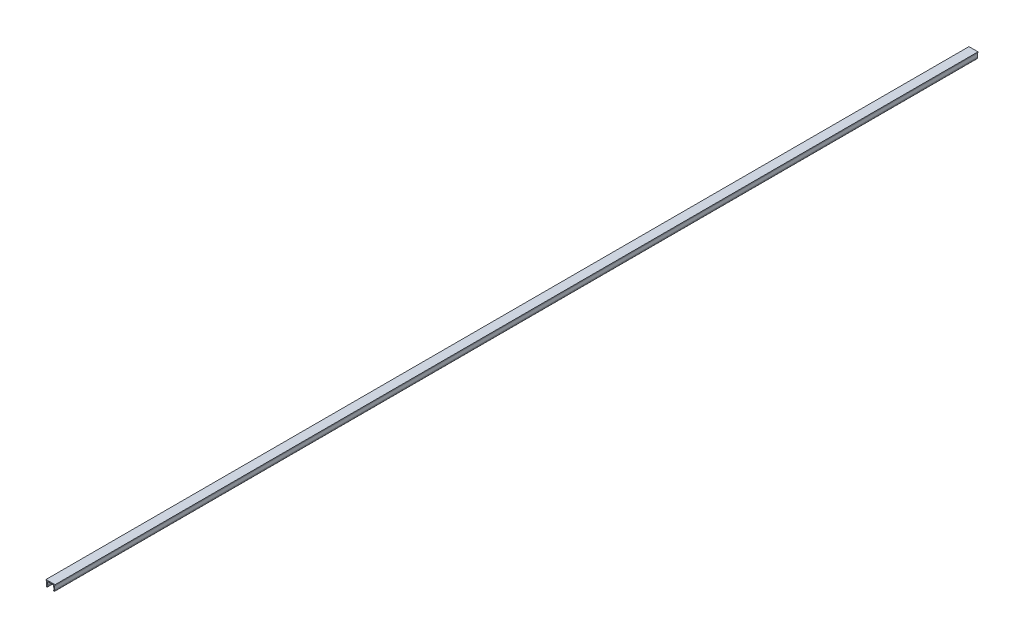
ISO-10303-21;
HEADER;
FILE_DESCRIPTION(('STEP AP214'),'2;1');
FILE_NAME('part.step','',(''),(''),'','','');
FILE_SCHEMA(('AUTOMOTIVE_DESIGN { 1 0 10303 214 1 1 1 1 }'));
ENDSEC;
DATA;
#1=APPLICATION_CONTEXT('core data for automotive mechanical design processes');
#2=APPLICATION_PROTOCOL_DEFINITION('international standard','automotive_design',2000,#1);
#3=PRODUCT_CONTEXT('',#1,'mechanical');
#4=PRODUCT('Part','Part','',(#3));
#5=PRODUCT_RELATED_PRODUCT_CATEGORY('part','',(#4));
#6=PRODUCT_DEFINITION_FORMATION('','',#4);
#7=PRODUCT_DEFINITION_CONTEXT('part definition',#1,'design');
#8=PRODUCT_DEFINITION('design','',#6,#7);
#9=PRODUCT_DEFINITION_SHAPE('','',#8);
#10=(LENGTH_UNIT() NAMED_UNIT(*) SI_UNIT(.MILLI.,.METRE.));
#11=(NAMED_UNIT(*) PLANE_ANGLE_UNIT() SI_UNIT($,.RADIAN.));
#12=(NAMED_UNIT(*) SI_UNIT($,.STERADIAN.) SOLID_ANGLE_UNIT());
#13=UNCERTAINTY_MEASURE_WITH_UNIT(LENGTH_MEASURE(1.E-05),#10,'distance_accuracy_value','');
#14=(GEOMETRIC_REPRESENTATION_CONTEXT(3) GLOBAL_UNCERTAINTY_ASSIGNED_CONTEXT((#13)) GLOBAL_UNIT_ASSIGNED_CONTEXT((#10,
#11,#12)) REPRESENTATION_CONTEXT('',''));
#15=CARTESIAN_POINT('',(0.,0.,0.));
#16=DIRECTION('',(0.,0.,1.));
#17=DIRECTION('',(1.,0.,0.));
#18=AXIS2_PLACEMENT_3D('',#15,#16,#17);
#19=CARTESIAN_POINT('',(-4.35,-0.5,500.));
#20=DIRECTION('',(0.998146155389155,-0.0608625704505581,0.));
#21=DIRECTION('',(0.0608625704505581,0.998146155389155,0.));
#22=AXIS2_PLACEMENT_3D('',#19,#20,#21);
#23=PLANE('',#22);
#24=DIRECTION('',(-0.0608625704505581,-0.998146155389155,0.));
#25=VECTOR('',#24,1.);
#26=CARTESIAN_POINT('',(-4.35,-0.5,-500.));
#27=LINE('',#26,#25);
#28=CARTESIAN_POINT('',(-4.35,-0.5,-500.));
#29=VERTEX_POINT('',#28);
#30=CARTESIAN_POINT('',(-4.6,-4.6,-500.));
#31=VERTEX_POINT('',#30);
#32=EDGE_CURVE('E178',#29,#31,#27,.T.);
#33=ORIENTED_EDGE('',*,*,#32,.T.);
#34=DIRECTION('',(0.,0.,-1.));
#35=VECTOR('',#34,1.);
#36=CARTESIAN_POINT('',(-4.6,-4.6,500.));
#37=LINE('',#36,#35);
#38=CARTESIAN_POINT('',(-4.6,-4.6,500.));
#39=VERTEX_POINT('',#38);
#40=EDGE_CURVE('E162',#39,#31,#37,.T.);
#41=ORIENTED_EDGE('',*,*,#40,.F.);
#42=DIRECTION('',(-0.0608625704505581,-0.998146155389155,0.));
#43=VECTOR('',#42,1.);
#44=CARTESIAN_POINT('',(-4.35,-0.5,500.));
#45=LINE('',#44,#43);
#46=CARTESIAN_POINT('',(-4.35,-0.5,500.));
#47=VERTEX_POINT('',#46);
#48=EDGE_CURVE('E166',#47,#39,#45,.T.);
#49=ORIENTED_EDGE('',*,*,#48,.F.);
#50=DIRECTION('',(0.,0.,-1.));
#51=VECTOR('',#50,1.);
#52=CARTESIAN_POINT('',(-4.35,-0.5,500.));
#53=LINE('',#52,#51);
#54=EDGE_CURVE('E269',#47,#29,#53,.T.);
#55=ORIENTED_EDGE('',*,*,#54,.T.);
#56=EDGE_LOOP('',(#33,#41,#49,#55));
#57=FACE_BOUND('',#56,.T.);
#58=ADVANCED_FACE('F16',(#57),#23,.F.);
#59=CARTESIAN_POINT('',(-4.6,-4.6,500.));
#60=DIRECTION('',(0.989359135364853,0.145493990494831,0.));
#61=DIRECTION('',(-0.145493990494831,0.989359135364853,0.));
#62=AXIS2_PLACEMENT_3D('',#59,#60,#61);
#63=PLANE('',#62);
#64=DIRECTION('',(0.145493990494831,-0.989359135364853,0.));
#65=VECTOR('',#64,1.);
#66=CARTESIAN_POINT('',(-4.6,-4.6,-500.));
#67=LINE('',#66,#65);
#68=CARTESIAN_POINT('',(-4.42274699524741,-5.80532043231757,-500.));
#69=VERTEX_POINT('',#68);
#70=EDGE_CURVE('E229',#31,#69,#67,.T.);
#71=ORIENTED_EDGE('',*,*,#70,.T.);
#72=DIRECTION('',(0.,0.,-1.));
#73=VECTOR('',#72,1.);
#74=CARTESIAN_POINT('',(-4.42274699524741,-5.80532043231757,500.));
#75=LINE('',#74,#73);
#76=CARTESIAN_POINT('',(-4.42274699524741,-5.80532043231757,500.));
#77=VERTEX_POINT('',#76);
#78=EDGE_CURVE('E25',#69,#77,#75,.F.);
#79=ORIENTED_EDGE('',*,*,#78,.T.);
#80=DIRECTION('',(0.145493990494831,-0.989359135364853,0.));
#81=VECTOR('',#80,1.);
#82=CARTESIAN_POINT('',(-4.6,-4.6,500.));
#83=LINE('',#82,#81);
#84=EDGE_CURVE('E157',#39,#77,#83,.T.);
#85=ORIENTED_EDGE('',*,*,#84,.F.);
#86=ORIENTED_EDGE('',*,*,#40,.T.);
#87=EDGE_LOOP('',(#71,#79,#85,#86));
#88=FACE_BOUND('',#87,.T.);
#89=ADVANCED_FACE('F160',(#88),#63,.F.);
#90=CARTESIAN_POINT('',(-3.59553467112894,-4.55722812534736,500.));
#91=DIRECTION('',(-0.989359135364853,-0.145493990494831,0.));
#92=DIRECTION('',(0.145493990494831,-0.989359135364853,0.));
#93=AXIS2_PLACEMENT_3D('',#90,#91,#92);
#94=PLANE('',#93);
#95=DIRECTION('',(-0.145493990494831,0.989359135364853,0.));
#96=VECTOR('',#95,1.);
#97=CARTESIAN_POINT('',(-3.59553467112894,-4.55722812534736,500.));
#98=LINE('',#97,#96);
#99=CARTESIAN_POINT('',(-3.43338785988256,-5.65982644182274,500.));
#100=VERTEX_POINT('',#99);
#101=CARTESIAN_POINT('',(-3.55021609061033,-4.86539447287392,500.));
#102=VERTEX_POINT('',#101);
#103=EDGE_CURVE('E165',#100,#102,#98,.T.);
#104=ORIENTED_EDGE('',*,*,#103,.F.);
#105=DIRECTION('',(0.,0.,-1.));
#106=VECTOR('',#105,1.);
#107=CARTESIAN_POINT('',(-3.43338785988256,-5.65982644182274,500.));
#108=LINE('',#107,#106);
#109=CARTESIAN_POINT('',(-3.43338785988256,-5.65982644182274,-500.));
#110=VERTEX_POINT('',#109);
#111=EDGE_CURVE('E10',#100,#110,#108,.T.);
#112=ORIENTED_EDGE('',*,*,#111,.T.);
#113=DIRECTION('',(-0.145493990494831,0.989359135364853,0.));
#114=VECTOR('',#113,1.);
#115=CARTESIAN_POINT('',(-3.59553467112894,-4.55722812534736,-500.));
#116=LINE('',#115,#114);
#117=CARTESIAN_POINT('',(-3.55021609061033,-4.86539447287392,-500.));
#118=VERTEX_POINT('',#117);
#119=EDGE_CURVE('E272',#110,#118,#116,.T.);
#120=ORIENTED_EDGE('',*,*,#119,.T.);
#121=DIRECTION('',(0.,0.,-1.));
#122=VECTOR('',#121,1.);
#123=CARTESIAN_POINT('',(-3.55021609061033,-4.86539447287392,500.));
#124=LINE('',#123,#122);
#125=EDGE_CURVE('E194',#118,#102,#124,.F.);
#126=ORIENTED_EDGE('',*,*,#125,.T.);
#127=EDGE_LOOP('',(#104,#112,#120,#126));
#128=FACE_BOUND('',#127,.T.);
#129=ADVANCED_FACE('F242',(#128),#94,.F.);
#130=CARTESIAN_POINT('',(-3.3481427122663,-0.5,500.));
#131=DIRECTION('',(-0.998146155389155,0.0608625704505579,0.));
#132=DIRECTION('',(-0.0608625704505579,-0.998146155389155,0.));
#133=AXIS2_PLACEMENT_3D('',#130,#131,#132);
#134=PLANE('',#133);
#135=DIRECTION('',(0.0608625704505579,0.998146155389155,0.));
#136=VECTOR('',#135,1.);
#137=CARTESIAN_POINT('',(-3.3481427122663,-0.5,500.));
#138=LINE('',#137,#136);
#139=CARTESIAN_POINT('',(-3.57657715068323,-4.24632479003775,500.));
#140=VERTEX_POINT('',#139);
#141=CARTESIAN_POINT('',(-3.3481427122663,-0.5,500.));
#142=VERTEX_POINT('',#141);
#143=EDGE_CURVE('E246',#140,#142,#138,.T.);
#144=ORIENTED_EDGE('',*,*,#143,.F.);
#145=DIRECTION('',(0.,0.,-1.));
#146=VECTOR('',#145,1.);
#147=CARTESIAN_POINT('',(-3.57657715068323,-4.24632479003775,-500.));
#148=LINE('',#147,#146);
#149=CARTESIAN_POINT('',(-3.57657715068323,-4.24632479003775,-500.));
#150=VERTEX_POINT('',#149);
#151=EDGE_CURVE('E191',#140,#150,#148,.T.);
#152=ORIENTED_EDGE('',*,*,#151,.T.);
#153=DIRECTION('',(0.0608625704505579,0.998146155389155,0.));
#154=VECTOR('',#153,1.);
#155=CARTESIAN_POINT('',(-3.3481427122663,-0.5,-500.));
#156=LINE('',#155,#154);
#157=CARTESIAN_POINT('',(-3.3481427122663,-0.5,-500.));
#158=VERTEX_POINT('',#157);
#159=EDGE_CURVE('E274',#150,#158,#156,.T.);
#160=ORIENTED_EDGE('',*,*,#159,.T.);
#161=DIRECTION('',(0.,0.,-1.));
#162=VECTOR('',#161,1.);
#163=CARTESIAN_POINT('',(-3.3481427122663,-0.5,500.));
#164=LINE('',#163,#162);
#165=EDGE_CURVE('E180',#142,#158,#164,.T.);
#166=ORIENTED_EDGE('',*,*,#165,.F.);
#167=EDGE_LOOP('',(#144,#152,#160,#166));
#168=FACE_BOUND('',#167,.T.);
#169=ADVANCED_FACE('F377',(#168),#134,.F.);
#170=CARTESIAN_POINT('',(-3.3481427122663,-0.5,500.));
#171=DIRECTION('',(0.,1.,0.));
#172=DIRECTION('',(-1.,0.,0.));
#173=AXIS2_PLACEMENT_3D('',#170,#171,#172);
#174=PLANE('',#173);
#175=DIRECTION('',(1.,0.,0.));
#176=VECTOR('',#175,1.);
#177=CARTESIAN_POINT('',(-3.3481427122663,-0.5,-500.));
#178=LINE('',#177,#176);
#179=CARTESIAN_POINT('',(3.3481427122663,-0.499999999999998,-500.));
#180=VERTEX_POINT('',#179);
#181=EDGE_CURVE('E276',#158,#180,#178,.T.);
#182=ORIENTED_EDGE('',*,*,#181,.T.);
#183=DIRECTION('',(0.,0.,-1.));
#184=VECTOR('',#183,1.);
#185=CARTESIAN_POINT('',(3.3481427122663,-0.499999999999998,500.));
#186=LINE('',#185,#184);
#187=CARTESIAN_POINT('',(3.3481427122663,-0.499999999999998,500.));
#188=VERTEX_POINT('',#187);
#189=EDGE_CURVE('E186',#188,#180,#186,.T.);
#190=ORIENTED_EDGE('',*,*,#189,.F.);
#191=DIRECTION('',(1.,0.,0.));
#192=VECTOR('',#191,1.);
#193=CARTESIAN_POINT('',(-3.3481427122663,-0.5,500.));
#194=LINE('',#193,#192);
#195=EDGE_CURVE('E248',#142,#188,#194,.T.);
#196=ORIENTED_EDGE('',*,*,#195,.F.);
#197=ORIENTED_EDGE('',*,*,#165,.T.);
#198=EDGE_LOOP('',(#182,#190,#196,#197));
#199=FACE_BOUND('',#198,.T.);
#200=ADVANCED_FACE('F378',(#199),#174,.F.);
#201=CARTESIAN_POINT('',(3.3481427122663,-0.499999999999998,500.));
#202=DIRECTION('',(0.998146155389155,0.0608625704505581,0.));
#203=DIRECTION('',(-0.0608625704505581,0.998146155389155,0.));
#204=AXIS2_PLACEMENT_3D('',#201,#202,#203);
#205=PLANE('',#204);
#206=DIRECTION('',(0.0608625704505581,-0.998146155389155,0.));
#207=VECTOR('',#206,1.);
#208=CARTESIAN_POINT('',(3.3481427122663,-0.499999999999998,-500.));
#209=LINE('',#208,#207);
#210=CARTESIAN_POINT('',(3.57657715068324,-4.24632479003775,-500.));
#211=VERTEX_POINT('',#210);
#212=EDGE_CURVE('E278',#180,#211,#209,.T.);
#213=ORIENTED_EDGE('',*,*,#212,.T.);
#214=DIRECTION('',(0.,0.,-1.));
#215=VECTOR('',#214,1.);
#216=CARTESIAN_POINT('',(3.57657715068324,-4.24632479003775,500.));
#217=LINE('',#216,#215);
#218=CARTESIAN_POINT('',(3.57657715068324,-4.24632479003775,500.));
#219=VERTEX_POINT('',#218);
#220=EDGE_CURVE('E183',#211,#219,#217,.F.);
#221=ORIENTED_EDGE('',*,*,#220,.T.);
#222=DIRECTION('',(0.0608625704505581,-0.998146155389155,0.));
#223=VECTOR('',#222,1.);
#224=CARTESIAN_POINT('',(3.3481427122663,-0.499999999999998,500.));
#225=LINE('',#224,#223);
#226=EDGE_CURVE('E252',#188,#219,#225,.T.);
#227=ORIENTED_EDGE('',*,*,#226,.F.);
#228=ORIENTED_EDGE('',*,*,#189,.T.);
#229=EDGE_LOOP('',(#213,#221,#227,#228));
#230=FACE_BOUND('',#229,.T.);
#231=ADVANCED_FACE('F319',(#230),#205,.F.);
#232=CARTESIAN_POINT('',(3.59553467112894,-4.55722812534736,500.));
#233=DIRECTION('',(0.989359135364853,-0.145493990494831,0.));
#234=DIRECTION('',(0.145493990494831,0.989359135364853,0.));
#235=AXIS2_PLACEMENT_3D('',#232,#233,#234);
#236=PLANE('',#235);
#237=DIRECTION('',(-0.145493990494831,-0.989359135364853,0.));
#238=VECTOR('',#237,1.);
#239=CARTESIAN_POINT('',(3.59553467112894,-4.55722812534736,-500.));
#240=LINE('',#239,#238);
#241=CARTESIAN_POINT('',(3.55021609061033,-4.86539447287392,-500.));
#242=VERTEX_POINT('',#241);
#243=CARTESIAN_POINT('',(3.43338785988256,-5.65982644182274,-500.));
#244=VERTEX_POINT('',#243);
#245=EDGE_CURVE('E281',#242,#244,#240,.T.);
#246=ORIENTED_EDGE('',*,*,#245,.T.);
#247=DIRECTION('',(0.,0.,-1.));
#248=VECTOR('',#247,1.);
#249=CARTESIAN_POINT('',(3.43338785988256,-5.65982644182274,500.));
#250=LINE('',#249,#248);
#251=CARTESIAN_POINT('',(3.43338785988256,-5.65982644182274,500.));
#252=VERTEX_POINT('',#251);
#253=EDGE_CURVE('E41',#244,#252,#250,.F.);
#254=ORIENTED_EDGE('',*,*,#253,.T.);
#255=DIRECTION('',(-0.145493990494831,-0.989359135364853,0.));
#256=VECTOR('',#255,1.);
#257=CARTESIAN_POINT('',(3.59553467112894,-4.55722812534736,500.));
#258=LINE('',#257,#256);
#259=CARTESIAN_POINT('',(3.55021609061033,-4.86539447287392,500.));
#260=VERTEX_POINT('',#259);
#261=EDGE_CURVE('E255',#260,#252,#258,.T.);
#262=ORIENTED_EDGE('',*,*,#261,.F.);
#263=DIRECTION('',(0.,0.,-1.));
#264=VECTOR('',#263,1.);
#265=CARTESIAN_POINT('',(3.55021609061033,-4.86539447287392,-500.));
#266=LINE('',#265,#264);
#267=EDGE_CURVE('E179',#260,#242,#266,.T.);
#268=ORIENTED_EDGE('',*,*,#267,.T.);
#269=EDGE_LOOP('',(#246,#254,#262,#268));
#270=FACE_BOUND('',#269,.T.);
#271=ADVANCED_FACE('F333',(#270),#236,.F.);
#272=CARTESIAN_POINT('',(4.6,-4.6,500.));
#273=DIRECTION('',(-0.989359135364853,0.145493990494831,0.));
#274=DIRECTION('',(-0.145493990494831,-0.989359135364853,0.));
#275=AXIS2_PLACEMENT_3D('',#272,#273,#274);
#276=PLANE('',#275);
#277=DIRECTION('',(0.145493990494831,0.989359135364853,0.));
#278=VECTOR('',#277,1.);
#279=CARTESIAN_POINT('',(4.6,-4.6,500.));
#280=LINE('',#279,#278);
#281=CARTESIAN_POINT('',(4.42274699524742,-5.80532043231757,500.));
#282=VERTEX_POINT('',#281);
#283=CARTESIAN_POINT('',(4.6,-4.6,500.));
#284=VERTEX_POINT('',#283);
#285=EDGE_CURVE('E257',#282,#284,#280,.T.);
#286=ORIENTED_EDGE('',*,*,#285,.F.);
#287=DIRECTION('',(0.,0.,-1.));
#288=VECTOR('',#287,1.);
#289=CARTESIAN_POINT('',(4.42274699524742,-5.80532043231757,500.));
#290=LINE('',#289,#288);
#291=CARTESIAN_POINT('',(4.42274699524742,-5.80532043231757,-500.));
#292=VERTEX_POINT('',#291);
#293=EDGE_CURVE('E206',#282,#292,#290,.T.);
#294=ORIENTED_EDGE('',*,*,#293,.T.);
#295=DIRECTION('',(0.145493990494831,0.989359135364853,0.));
#296=VECTOR('',#295,1.);
#297=CARTESIAN_POINT('',(4.6,-4.6,-500.));
#298=LINE('',#297,#296);
#299=CARTESIAN_POINT('',(4.6,-4.6,-500.));
#300=VERTEX_POINT('',#299);
#301=EDGE_CURVE('E283',#292,#300,#298,.T.);
#302=ORIENTED_EDGE('',*,*,#301,.T.);
#303=DIRECTION('',(0.,0.,-1.));
#304=VECTOR('',#303,1.);
#305=CARTESIAN_POINT('',(4.6,-4.6,500.));
#306=LINE('',#305,#304);
#307=EDGE_CURVE('E312',#284,#300,#306,.T.);
#308=ORIENTED_EDGE('',*,*,#307,.F.);
#309=EDGE_LOOP('',(#286,#294,#302,#308));
#310=FACE_BOUND('',#309,.T.);
#311=ADVANCED_FACE('F342',(#310),#276,.F.);
#312=CARTESIAN_POINT('',(4.35,-0.499999999999999,500.));
#313=DIRECTION('',(-0.998146155389155,-0.0608625704505585,0.));
#314=DIRECTION('',(0.0608625704505585,-0.998146155389155,0.));
#315=AXIS2_PLACEMENT_3D('',#312,#313,#314);
#316=PLANE('',#315);
#317=DIRECTION('',(-0.0608625704505585,0.998146155389155,0.));
#318=VECTOR('',#317,1.);
#319=CARTESIAN_POINT('',(4.35,-0.499999999999999,-500.));
#320=LINE('',#319,#318);
#321=CARTESIAN_POINT('',(4.35,-0.499999999999999,-500.));
#322=VERTEX_POINT('',#321);
#323=EDGE_CURVE('E285',#300,#322,#320,.T.);
#324=ORIENTED_EDGE('',*,*,#323,.T.);
#325=DIRECTION('',(0.,0.,-1.));
#326=VECTOR('',#325,1.);
#327=CARTESIAN_POINT('',(4.35,-0.499999999999999,500.));
#328=LINE('',#327,#326);
#329=CARTESIAN_POINT('',(4.35,-0.499999999999999,500.));
#330=VERTEX_POINT('',#329);
#331=EDGE_CURVE('E309',#330,#322,#328,.T.);
#332=ORIENTED_EDGE('',*,*,#331,.F.);
#333=DIRECTION('',(-0.0608625704505585,0.998146155389155,0.));
#334=VECTOR('',#333,1.);
#335=CARTESIAN_POINT('',(4.35,-0.499999999999999,500.));
#336=LINE('',#335,#334);
#337=EDGE_CURVE('E259',#284,#330,#336,.T.);
#338=ORIENTED_EDGE('',*,*,#337,.F.);
#339=ORIENTED_EDGE('',*,*,#307,.T.);
#340=EDGE_LOOP('',(#324,#332,#338,#339));
#341=FACE_BOUND('',#340,.T.);
#342=ADVANCED_FACE('F347',(#341),#316,.F.);
#343=CARTESIAN_POINT('',(4.35,-0.499999999999999,500.));
#344=DIRECTION('',(0.,1.,0.));
#345=DIRECTION('',(-1.,0.,0.));
#346=AXIS2_PLACEMENT_3D('',#343,#344,#345);
#347=PLANE('',#346);
#348=DIRECTION('',(1.,0.,0.));
#349=VECTOR('',#348,1.);
#350=CARTESIAN_POINT('',(4.35,-0.499999999999999,-500.));
#351=LINE('',#350,#349);
#352=CARTESIAN_POINT('',(4.9,-0.5,-500.));
#353=VERTEX_POINT('',#352);
#354=EDGE_CURVE('E287',#322,#353,#351,.T.);
#355=ORIENTED_EDGE('',*,*,#354,.T.);
#356=DIRECTION('',(0.,0.,-1.));
#357=VECTOR('',#356,1.);
#358=CARTESIAN_POINT('',(4.9,-0.5,500.));
#359=LINE('',#358,#357);
#360=CARTESIAN_POINT('',(4.9,-0.5,500.));
#361=VERTEX_POINT('',#360);
#362=EDGE_CURVE('E306',#361,#353,#359,.T.);
#363=ORIENTED_EDGE('',*,*,#362,.F.);
#364=DIRECTION('',(1.,0.,0.));
#365=VECTOR('',#364,1.);
#366=CARTESIAN_POINT('',(4.35,-0.499999999999999,500.));
#367=LINE('',#366,#365);
#368=EDGE_CURVE('E261',#330,#361,#367,.T.);
#369=ORIENTED_EDGE('',*,*,#368,.F.);
#370=ORIENTED_EDGE('',*,*,#331,.T.);
#371=EDGE_LOOP('',(#355,#363,#369,#370));
#372=FACE_BOUND('',#371,.T.);
#373=ADVANCED_FACE('F353',(#372),#347,.F.);
#374=CARTESIAN_POINT('',(4.9,0.5,500.));
#375=DIRECTION('',(-1.,0.,0.));
#376=DIRECTION('',(0.,0.,1.));
#377=AXIS2_PLACEMENT_3D('',#374,#375,#376);
#378=PLANE('',#377);
#379=DIRECTION('',(0.,1.,0.));
#380=VECTOR('',#379,1.);
#381=CARTESIAN_POINT('',(4.9,0.5,-500.));
#382=LINE('',#381,#380);
#383=CARTESIAN_POINT('',(4.9,0.5,-500.));
#384=VERTEX_POINT('',#383);
#385=EDGE_CURVE('E289',#353,#384,#382,.T.);
#386=ORIENTED_EDGE('',*,*,#385,.T.);
#387=DIRECTION('',(0.,0.,-1.));
#388=VECTOR('',#387,1.);
#389=CARTESIAN_POINT('',(4.9,0.5,500.));
#390=LINE('',#389,#388);
#391=CARTESIAN_POINT('',(4.9,0.5,500.));
#392=VERTEX_POINT('',#391);
#393=EDGE_CURVE('E303',#392,#384,#390,.T.);
#394=ORIENTED_EDGE('',*,*,#393,.F.);
#395=DIRECTION('',(0.,1.,0.));
#396=VECTOR('',#395,1.);
#397=CARTESIAN_POINT('',(4.9,0.5,500.));
#398=LINE('',#397,#396);
#399=EDGE_CURVE('E263',#361,#392,#398,.T.);
#400=ORIENTED_EDGE('',*,*,#399,.F.);
#401=ORIENTED_EDGE('',*,*,#362,.T.);
#402=EDGE_LOOP('',(#386,#394,#400,#401));
#403=FACE_BOUND('',#402,.T.);
#404=ADVANCED_FACE('F357',(#403),#378,.F.);
#405=CARTESIAN_POINT('',(-4.9,0.5,500.));
#406=DIRECTION('',(0.,-1.,0.));
#407=DIRECTION('',(0.,0.,-1.));
#408=AXIS2_PLACEMENT_3D('',#405,#406,#407);
#409=PLANE('',#408);
#410=DIRECTION('',(-1.,0.,0.));
#411=VECTOR('',#410,1.);
#412=CARTESIAN_POINT('',(-4.9,0.5,-500.));
#413=LINE('',#412,#411);
#414=CARTESIAN_POINT('',(-4.9,0.5,-500.));
#415=VERTEX_POINT('',#414);
#416=EDGE_CURVE('E291',#384,#415,#413,.T.);
#417=ORIENTED_EDGE('',*,*,#416,.T.);
#418=DIRECTION('',(0.,0.,-1.));
#419=VECTOR('',#418,1.);
#420=CARTESIAN_POINT('',(-4.9,0.5,500.));
#421=LINE('',#420,#419);
#422=CARTESIAN_POINT('',(-4.9,0.5,500.));
#423=VERTEX_POINT('',#422);
#424=EDGE_CURVE('E300',#423,#415,#421,.T.);
#425=ORIENTED_EDGE('',*,*,#424,.F.);
#426=DIRECTION('',(-1.,0.,0.));
#427=VECTOR('',#426,1.);
#428=CARTESIAN_POINT('',(-4.9,0.5,500.));
#429=LINE('',#428,#427);
#430=EDGE_CURVE('E265',#392,#423,#429,.T.);
#431=ORIENTED_EDGE('',*,*,#430,.F.);
#432=ORIENTED_EDGE('',*,*,#393,.T.);
#433=EDGE_LOOP('',(#417,#425,#431,#432));
#434=FACE_BOUND('',#433,.T.);
#435=ADVANCED_FACE('F362',(#434),#409,.F.);
#436=CARTESIAN_POINT('',(-4.9,0.5,500.));
#437=DIRECTION('',(1.,0.,0.));
#438=DIRECTION('',(0.,0.,-1.));
#439=AXIS2_PLACEMENT_3D('',#436,#437,#438);
#440=PLANE('',#439);
#441=DIRECTION('',(0.,-1.,0.));
#442=VECTOR('',#441,1.);
#443=CARTESIAN_POINT('',(-4.9,0.5,-500.));
#444=LINE('',#443,#442);
#445=CARTESIAN_POINT('',(-4.9,-0.5,-500.));
#446=VERTEX_POINT('',#445);
#447=EDGE_CURVE('E293',#415,#446,#444,.T.);
#448=ORIENTED_EDGE('',*,*,#447,.T.);
#449=DIRECTION('',(0.,0.,-1.));
#450=VECTOR('',#449,1.);
#451=CARTESIAN_POINT('',(-4.9,-0.5,500.));
#452=LINE('',#451,#450);
#453=CARTESIAN_POINT('',(-4.9,-0.5,500.));
#454=VERTEX_POINT('',#453);
#455=EDGE_CURVE('E297',#454,#446,#452,.T.);
#456=ORIENTED_EDGE('',*,*,#455,.F.);
#457=DIRECTION('',(0.,-1.,0.));
#458=VECTOR('',#457,1.);
#459=CARTESIAN_POINT('',(-4.9,0.5,500.));
#460=LINE('',#459,#458);
#461=EDGE_CURVE('E267',#423,#454,#460,.T.);
#462=ORIENTED_EDGE('',*,*,#461,.F.);
#463=ORIENTED_EDGE('',*,*,#424,.T.);
#464=EDGE_LOOP('',(#448,#456,#462,#463));
#465=FACE_BOUND('',#464,.T.);
#466=ADVANCED_FACE('F366',(#465),#440,.F.);
#467=CARTESIAN_POINT('',(-4.9,-0.5,500.));
#468=DIRECTION('',(0.,1.,0.));
#469=DIRECTION('',(-1.,0.,0.));
#470=AXIS2_PLACEMENT_3D('',#467,#468,#469);
#471=PLANE('',#470);
#472=DIRECTION('',(1.,0.,0.));
#473=VECTOR('',#472,1.);
#474=CARTESIAN_POINT('',(-4.9,-0.5,-500.));
#475=LINE('',#474,#473);
#476=EDGE_CURVE('E175',#446,#29,#475,.T.);
#477=ORIENTED_EDGE('',*,*,#476,.T.);
#478=ORIENTED_EDGE('',*,*,#54,.F.);
#479=DIRECTION('',(1.,0.,0.));
#480=VECTOR('',#479,1.);
#481=CARTESIAN_POINT('',(-4.9,-0.5,500.));
#482=LINE('',#481,#480);
#483=EDGE_CURVE('E171',#454,#47,#482,.T.);
#484=ORIENTED_EDGE('',*,*,#483,.F.);
#485=ORIENTED_EDGE('',*,*,#455,.T.);
#486=EDGE_LOOP('',(#477,#478,#484,#485));
#487=FACE_BOUND('',#486,.T.);
#488=ADVANCED_FACE('F370',(#487),#471,.F.);
#489=CARTESIAN_POINT('',(0.,0.,500.));
#490=DIRECTION('',(0.,0.,1.));
#491=DIRECTION('',(1.,0.,0.));
#492=AXIS2_PLACEMENT_3D('',#489,#490,#491);
#493=PLANE('',#492);
#494=CARTESIAN_POINT('',(3.92806742756499,-5.73257343707016,500.));
#495=DIRECTION('',(0.,0.,1.));
#496=DIRECTION('',(1.,0.,0.));
#497=AXIS2_PLACEMENT_3D('',#494,#495,#496);
#498=CIRCLE('',#497,0.5);
#499=CARTESIAN_POINT('',(3.85532043231757,-6.22725300475258,500.));
#500=VERTEX_POINT('',#499);
#501=EDGE_CURVE('E33',#252,#500,#498,.T.);
#502=ORIENTED_EDGE('',*,*,#501,.T.);
#503=CARTESIAN_POINT('',(3.92806742756499,-5.73257343707016,500.));
#504=DIRECTION('',(0.,0.,1.));
#505=DIRECTION('',(1.,0.,0.));
#506=AXIS2_PLACEMENT_3D('',#503,#504,#505);
#507=CIRCLE('',#506,0.5);
#508=EDGE_CURVE('E222',#500,#282,#507,.T.);
#509=ORIENTED_EDGE('',*,*,#508,.T.);
#510=ORIENTED_EDGE('',*,*,#285,.T.);
#511=ORIENTED_EDGE('',*,*,#337,.T.);
#512=ORIENTED_EDGE('',*,*,#368,.T.);
#513=ORIENTED_EDGE('',*,*,#399,.T.);
#514=ORIENTED_EDGE('',*,*,#430,.T.);
#515=ORIENTED_EDGE('',*,*,#461,.T.);
#516=ORIENTED_EDGE('',*,*,#483,.T.);
#517=ORIENTED_EDGE('',*,*,#48,.T.);
#518=ORIENTED_EDGE('',*,*,#84,.T.);
#519=CARTESIAN_POINT('',(-3.92806742756499,-5.73257343707016,500.));
#520=DIRECTION('',(0.,0.,1.));
#521=DIRECTION('',(1.,0.,0.));
#522=AXIS2_PLACEMENT_3D('',#519,#520,#521);
#523=CIRCLE('',#522,0.5);
#524=CARTESIAN_POINT('',(-3.85532043231757,-6.22725300475258,500.));
#525=VERTEX_POINT('',#524);
#526=EDGE_CURVE('E219',#77,#525,#523,.T.);
#527=ORIENTED_EDGE('',*,*,#526,.T.);
#528=CARTESIAN_POINT('',(-3.92806742756499,-5.73257343707016,500.));
#529=DIRECTION('',(0.,0.,1.));
#530=DIRECTION('',(1.,0.,0.));
#531=AXIS2_PLACEMENT_3D('',#528,#529,#530);
#532=CIRCLE('',#531,0.5);
#533=EDGE_CURVE('E217',#525,#100,#532,.T.);
#534=ORIENTED_EDGE('',*,*,#533,.T.);
#535=ORIENTED_EDGE('',*,*,#103,.T.);
#536=CARTESIAN_POINT('',(-0.582138684515768,-4.42891250138943,500.));
#537=DIRECTION('',(0.,0.,1.));
#538=DIRECTION('',(1.,0.,0.));
#539=AXIS2_PLACEMENT_3D('',#536,#537,#538);
#540=CIRCLE('',#539,3.);
#541=EDGE_CURVE('E204',#102,#140,#540,.F.);
#542=ORIENTED_EDGE('',*,*,#541,.T.);
#543=ORIENTED_EDGE('',*,*,#143,.T.);
#544=ORIENTED_EDGE('',*,*,#195,.T.);
#545=ORIENTED_EDGE('',*,*,#226,.T.);
#546=CARTESIAN_POINT('',(0.582138684515771,-4.42891250138943,500.));
#547=DIRECTION('',(0.,0.,1.));
#548=DIRECTION('',(1.,0.,0.));
#549=AXIS2_PLACEMENT_3D('',#546,#547,#548);
#550=CIRCLE('',#549,3.);
#551=EDGE_CURVE('E199',#219,#260,#550,.F.);
#552=ORIENTED_EDGE('',*,*,#551,.T.);
#553=ORIENTED_EDGE('',*,*,#261,.T.);
#554=EDGE_LOOP('',(#502,#509,#510,#511,#512,#513,#514,#515,#516,#517,#518,#527,#534,#535,#542,
#543,#544,#545,#552,#553));
#555=FACE_BOUND('',#554,.T.);
#556=ADVANCED_FACE('F169',(#555),#493,.T.);
#557=CARTESIAN_POINT('',(0.,0.,-500.));
#558=DIRECTION('',(0.,0.,1.));
#559=DIRECTION('',(1.,0.,0.));
#560=AXIS2_PLACEMENT_3D('',#557,#558,#559);
#561=PLANE('',#560);
#562=ORIENTED_EDGE('',*,*,#301,.F.);
#563=CARTESIAN_POINT('',(3.92806742756499,-5.73257343707016,-500.));
#564=DIRECTION('',(0.,0.,1.));
#565=DIRECTION('',(1.,0.,0.));
#566=AXIS2_PLACEMENT_3D('',#563,#564,#565);
#567=CIRCLE('',#566,0.5);
#568=CARTESIAN_POINT('',(3.85532043231757,-6.22725300475258,-500.));
#569=VERTEX_POINT('',#568);
#570=EDGE_CURVE('E215',#292,#569,#567,.F.);
#571=ORIENTED_EDGE('',*,*,#570,.T.);
#572=CARTESIAN_POINT('',(3.92806742756499,-5.73257343707016,-500.));
#573=DIRECTION('',(0.,0.,1.));
#574=DIRECTION('',(1.,0.,0.));
#575=AXIS2_PLACEMENT_3D('',#572,#573,#574);
#576=CIRCLE('',#575,0.5);
#577=EDGE_CURVE('E213',#569,#244,#576,.F.);
#578=ORIENTED_EDGE('',*,*,#577,.T.);
#579=ORIENTED_EDGE('',*,*,#245,.F.);
#580=CARTESIAN_POINT('',(0.582138684515771,-4.42891250138943,-500.));
#581=DIRECTION('',(0.,0.,1.));
#582=DIRECTION('',(1.,0.,0.));
#583=AXIS2_PLACEMENT_3D('',#580,#581,#582);
#584=CIRCLE('',#583,3.);
#585=EDGE_CURVE('E197',#242,#211,#584,.T.);
#586=ORIENTED_EDGE('',*,*,#585,.T.);
#587=ORIENTED_EDGE('',*,*,#212,.F.);
#588=ORIENTED_EDGE('',*,*,#181,.F.);
#589=ORIENTED_EDGE('',*,*,#159,.F.);
#590=CARTESIAN_POINT('',(-0.582138684515768,-4.42891250138943,-500.));
#591=DIRECTION('',(0.,0.,1.));
#592=DIRECTION('',(1.,0.,0.));
#593=AXIS2_PLACEMENT_3D('',#590,#591,#592);
#594=CIRCLE('',#593,3.);
#595=EDGE_CURVE('E201',#150,#118,#594,.T.);
#596=ORIENTED_EDGE('',*,*,#595,.T.);
#597=ORIENTED_EDGE('',*,*,#119,.F.);
#598=CARTESIAN_POINT('',(-3.92806742756499,-5.73257343707016,-500.));
#599=DIRECTION('',(0.,0.,1.));
#600=DIRECTION('',(1.,0.,0.));
#601=AXIS2_PLACEMENT_3D('',#598,#599,#600);
#602=CIRCLE('',#601,0.5);
#603=CARTESIAN_POINT('',(-3.85532043231757,-6.22725300475258,-500.));
#604=VERTEX_POINT('',#603);
#605=EDGE_CURVE('E209',#110,#604,#602,.F.);
#606=ORIENTED_EDGE('',*,*,#605,.T.);
#607=CARTESIAN_POINT('',(-3.92806742756499,-5.73257343707016,-500.));
#608=DIRECTION('',(0.,0.,1.));
#609=DIRECTION('',(1.,0.,0.));
#610=AXIS2_PLACEMENT_3D('',#607,#608,#609);
#611=CIRCLE('',#610,0.5);
#612=EDGE_CURVE('E211',#604,#69,#611,.F.);
#613=ORIENTED_EDGE('',*,*,#612,.T.);
#614=ORIENTED_EDGE('',*,*,#70,.F.);
#615=ORIENTED_EDGE('',*,*,#32,.F.);
#616=ORIENTED_EDGE('',*,*,#476,.F.);
#617=ORIENTED_EDGE('',*,*,#447,.F.);
#618=ORIENTED_EDGE('',*,*,#416,.F.);
#619=ORIENTED_EDGE('',*,*,#385,.F.);
#620=ORIENTED_EDGE('',*,*,#354,.F.);
#621=ORIENTED_EDGE('',*,*,#323,.F.);
#622=EDGE_LOOP('',(#562,#571,#578,#579,#586,#587,#588,#589,#596,#597,#606,#613,#614,#615,#616,
#617,#618,#619,#620,#621));
#623=FACE_BOUND('',#622,.T.);
#624=ADVANCED_FACE('F326',(#623),#561,.F.);
#625=CARTESIAN_POINT('',(0.582138684515771,-4.42891250138943,500.));
#626=DIRECTION('',(0.,0.,1.));
#627=DIRECTION('',(1.,0.,0.));
#628=AXIS2_PLACEMENT_3D('',#625,#626,#627);
#629=CYLINDRICAL_SURFACE('',#628,3.);
#630=ORIENTED_EDGE('',*,*,#551,.F.);
#631=ORIENTED_EDGE('',*,*,#220,.F.);
#632=ORIENTED_EDGE('',*,*,#585,.F.);
#633=ORIENTED_EDGE('',*,*,#267,.F.);
#634=EDGE_LOOP('',(#630,#631,#632,#633));
#635=FACE_BOUND('',#634,.T.);
#636=ADVANCED_FACE('F332',(#635),#629,.F.);
#637=CARTESIAN_POINT('',(-0.582138684515768,-4.42891250138943,500.));
#638=DIRECTION('',(0.,0.,1.));
#639=DIRECTION('',(1.,0.,0.));
#640=AXIS2_PLACEMENT_3D('',#637,#638,#639);
#641=CYLINDRICAL_SURFACE('',#640,3.);
#642=ORIENTED_EDGE('',*,*,#541,.F.);
#643=ORIENTED_EDGE('',*,*,#125,.F.);
#644=ORIENTED_EDGE('',*,*,#595,.F.);
#645=ORIENTED_EDGE('',*,*,#151,.F.);
#646=EDGE_LOOP('',(#642,#643,#644,#645));
#647=FACE_BOUND('',#646,.T.);
#648=ADVANCED_FACE('F373',(#647),#641,.F.);
#649=CARTESIAN_POINT('',(3.92806742756499,-5.73257343707016,500.));
#650=DIRECTION('',(0.,0.,-1.));
#651=DIRECTION('',(-1.,0.,0.));
#652=AXIS2_PLACEMENT_3D('',#649,#650,#651);
#653=CYLINDRICAL_SURFACE('',#652,0.5);
#654=DIRECTION('',(0.,0.,-1.));
#655=VECTOR('',#654,1.);
#656=CARTESIAN_POINT('',(3.85532043231757,-6.22725300475258,500.));
#657=LINE('',#656,#655);
#658=EDGE_CURVE('E225',#500,#569,#657,.T.);
#659=ORIENTED_EDGE('',*,*,#658,.F.);
#660=ORIENTED_EDGE('',*,*,#501,.F.);
#661=ORIENTED_EDGE('',*,*,#253,.F.);
#662=ORIENTED_EDGE('',*,*,#577,.F.);
#663=EDGE_LOOP('',(#659,#660,#661,#662));
#664=FACE_BOUND('',#663,.T.);
#665=ADVANCED_FACE('F335',(#664),#653,.T.);
#666=CARTESIAN_POINT('',(3.92806742756499,-5.73257343707016,500.));
#667=DIRECTION('',(0.,0.,-1.));
#668=DIRECTION('',(-1.,0.,0.));
#669=AXIS2_PLACEMENT_3D('',#666,#667,#668);
#670=CYLINDRICAL_SURFACE('',#669,0.5);
#671=ORIENTED_EDGE('',*,*,#508,.F.);
#672=ORIENTED_EDGE('',*,*,#658,.T.);
#673=ORIENTED_EDGE('',*,*,#570,.F.);
#674=ORIENTED_EDGE('',*,*,#293,.F.);
#675=EDGE_LOOP('',(#671,#672,#673,#674));
#676=FACE_BOUND('',#675,.T.);
#677=ADVANCED_FACE('F338',(#676),#670,.T.);
#678=CARTESIAN_POINT('',(-3.92806742756499,-5.73257343707016,500.));
#679=DIRECTION('',(0.,0.,-1.));
#680=DIRECTION('',(-1.,0.,0.));
#681=AXIS2_PLACEMENT_3D('',#678,#679,#680);
#682=CYLINDRICAL_SURFACE('',#681,0.5);
#683=ORIENTED_EDGE('',*,*,#111,.F.);
#684=ORIENTED_EDGE('',*,*,#533,.F.);
#685=DIRECTION('',(0.,0.,-1.));
#686=VECTOR('',#685,1.);
#687=CARTESIAN_POINT('',(-3.85532043231757,-6.22725300475258,500.));
#688=LINE('',#687,#686);
#689=EDGE_CURVE('E20',#604,#525,#688,.F.);
#690=ORIENTED_EDGE('',*,*,#689,.F.);
#691=ORIENTED_EDGE('',*,*,#605,.F.);
#692=EDGE_LOOP('',(#683,#684,#690,#691));
#693=FACE_BOUND('',#692,.T.);
#694=ADVANCED_FACE('F18',(#693),#682,.T.);
#695=CARTESIAN_POINT('',(-3.92806742756499,-5.73257343707016,500.));
#696=DIRECTION('',(0.,0.,-1.));
#697=DIRECTION('',(-1.,0.,0.));
#698=AXIS2_PLACEMENT_3D('',#695,#696,#697);
#699=CYLINDRICAL_SURFACE('',#698,0.5);
#700=ORIENTED_EDGE('',*,*,#526,.F.);
#701=ORIENTED_EDGE('',*,*,#78,.F.);
#702=ORIENTED_EDGE('',*,*,#612,.F.);
#703=ORIENTED_EDGE('',*,*,#689,.T.);
#704=EDGE_LOOP('',(#700,#701,#702,#703));
#705=FACE_BOUND('',#704,.T.);
#706=ADVANCED_FACE('F235',(#705),#699,.T.);
#707=CLOSED_SHELL('',(#58,#89,#129,#169,#200,#231,#271,#311,#342,#373,#404,#435,#466,#488,#556,
#624,#636,#648,#665,#677,#694,#706));
#708=MANIFOLD_SOLID_BREP('B1',#707);
#709=ADVANCED_BREP_SHAPE_REPRESENTATION('',(#18,#708),#14);
#710=SHAPE_DEFINITION_REPRESENTATION(#9,#709);
ENDSEC;
END-ISO-10303-21;
